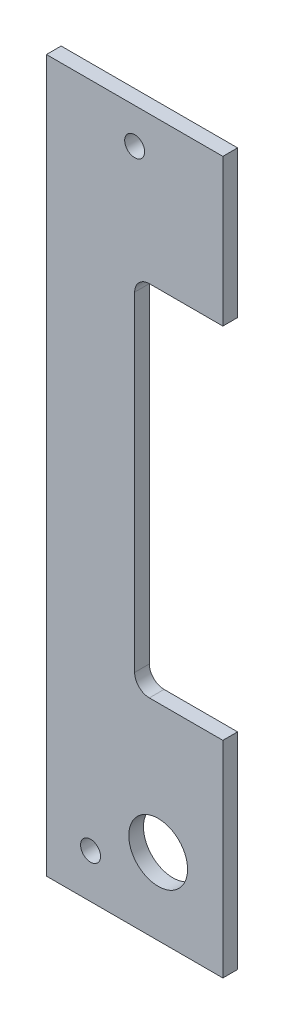
ISO-10303-21;
HEADER;
FILE_DESCRIPTION(('STEP AP214'),'2;1');
FILE_NAME('part.step','',(''),(''),'','','');
FILE_SCHEMA(('AUTOMOTIVE_DESIGN { 1 0 10303 214 1 1 1 1 }'));
ENDSEC;
DATA;
#1=APPLICATION_CONTEXT('core data for automotive mechanical design processes');
#2=APPLICATION_PROTOCOL_DEFINITION('international standard','automotive_design',2000,#1);
#3=PRODUCT_CONTEXT('',#1,'mechanical');
#4=PRODUCT('Part','Part','',(#3));
#5=PRODUCT_RELATED_PRODUCT_CATEGORY('part','',(#4));
#6=PRODUCT_DEFINITION_FORMATION('','',#4);
#7=PRODUCT_DEFINITION_CONTEXT('part definition',#1,'design');
#8=PRODUCT_DEFINITION('design','',#6,#7);
#9=PRODUCT_DEFINITION_SHAPE('','',#8);
#10=(LENGTH_UNIT() NAMED_UNIT(*) SI_UNIT(.MILLI.,.METRE.));
#11=(NAMED_UNIT(*) PLANE_ANGLE_UNIT() SI_UNIT($,.RADIAN.));
#12=(NAMED_UNIT(*) SI_UNIT($,.STERADIAN.) SOLID_ANGLE_UNIT());
#13=UNCERTAINTY_MEASURE_WITH_UNIT(LENGTH_MEASURE(1.E-05),#10,'distance_accuracy_value','');
#14=(GEOMETRIC_REPRESENTATION_CONTEXT(3) GLOBAL_UNCERTAINTY_ASSIGNED_CONTEXT((#13)) GLOBAL_UNIT_ASSIGNED_CONTEXT((#10,
#11,#12)) REPRESENTATION_CONTEXT('',''));
#15=CARTESIAN_POINT('',(0.,0.,0.));
#16=DIRECTION('',(0.,0.,1.));
#17=DIRECTION('',(1.,0.,0.));
#18=AXIS2_PLACEMENT_3D('',#15,#16,#17);
#19=CARTESIAN_POINT('',(-38.1,0.,3.175));
#20=DIRECTION('',(0.,1.,0.));
#21=DIRECTION('',(-1.,0.,0.));
#22=AXIS2_PLACEMENT_3D('',#19,#20,#21);
#23=PLANE('',#22);
#24=DIRECTION('',(1.,0.,0.));
#25=VECTOR('',#24,1.);
#26=CARTESIAN_POINT('',(-38.1,0.,0.));
#27=LINE('',#26,#25);
#28=CARTESIAN_POINT('',(-38.1,0.,0.));
#29=VERTEX_POINT('',#28);
#30=CARTESIAN_POINT('',(0.,0.,0.));
#31=VERTEX_POINT('',#30);
#32=EDGE_CURVE('E140',#29,#31,#27,.T.);
#33=ORIENTED_EDGE('',*,*,#32,.T.);
#34=DIRECTION('',(0.,0.,-1.));
#35=VECTOR('',#34,1.);
#36=CARTESIAN_POINT('',(0.,0.,3.175));
#37=LINE('',#36,#35);
#38=CARTESIAN_POINT('',(0.,0.,3.175));
#39=VERTEX_POINT('',#38);
#40=EDGE_CURVE('E11',#39,#31,#37,.T.);
#41=ORIENTED_EDGE('',*,*,#40,.F.);
#42=DIRECTION('',(1.,0.,0.));
#43=VECTOR('',#42,1.);
#44=CARTESIAN_POINT('',(-38.1,0.,3.175));
#45=LINE('',#44,#43);
#46=CARTESIAN_POINT('',(-38.1,0.,3.175));
#47=VERTEX_POINT('',#46);
#48=EDGE_CURVE('E159',#47,#39,#45,.T.);
#49=ORIENTED_EDGE('',*,*,#48,.F.);
#50=DIRECTION('',(0.,0.,-1.));
#51=VECTOR('',#50,1.);
#52=CARTESIAN_POINT('',(-38.1,0.,3.175));
#53=LINE('',#52,#51);
#54=EDGE_CURVE('E136',#47,#29,#53,.T.);
#55=ORIENTED_EDGE('',*,*,#54,.T.);
#56=EDGE_LOOP('',(#33,#41,#49,#55));
#57=FACE_BOUND('',#56,.T.);
#58=ADVANCED_FACE('F32',(#57),#23,.F.);
#59=CARTESIAN_POINT('',(0.,0.,3.175));
#60=DIRECTION('',(-1.,0.,0.));
#61=DIRECTION('',(0.,-1.,0.));
#62=AXIS2_PLACEMENT_3D('',#59,#60,#61);
#63=PLANE('',#62);
#64=DIRECTION('',(0.,1.,0.));
#65=VECTOR('',#64,1.);
#66=CARTESIAN_POINT('',(0.,0.,0.));
#67=LINE('',#66,#65);
#68=CARTESIAN_POINT('',(0.,44.45,0.));
#69=VERTEX_POINT('',#68);
#70=EDGE_CURVE('E143',#31,#69,#67,.T.);
#71=ORIENTED_EDGE('',*,*,#70,.T.);
#72=DIRECTION('',(0.,0.,-1.));
#73=VECTOR('',#72,1.);
#74=CARTESIAN_POINT('',(0.,44.45,3.175));
#75=LINE('',#74,#73);
#76=CARTESIAN_POINT('',(0.,44.45,3.175));
#77=VERTEX_POINT('',#76);
#78=EDGE_CURVE('E40',#77,#69,#75,.T.);
#79=ORIENTED_EDGE('',*,*,#78,.F.);
#80=DIRECTION('',(0.,1.,0.));
#81=VECTOR('',#80,1.);
#82=CARTESIAN_POINT('',(0.,0.,3.175));
#83=LINE('',#82,#81);
#84=EDGE_CURVE('E97',#39,#77,#83,.T.);
#85=ORIENTED_EDGE('',*,*,#84,.F.);
#86=ORIENTED_EDGE('',*,*,#40,.T.);
#87=EDGE_LOOP('',(#71,#79,#85,#86));
#88=FACE_BOUND('',#87,.T.);
#89=ADVANCED_FACE('F246',(#88),#63,.F.);
#90=CARTESIAN_POINT('',(0.,44.45,3.175));
#91=DIRECTION('',(0.,-1.,0.));
#92=DIRECTION('',(0.,0.,-1.));
#93=AXIS2_PLACEMENT_3D('',#90,#91,#92);
#94=PLANE('',#93);
#95=DIRECTION('',(-1.,0.,0.));
#96=VECTOR('',#95,1.);
#97=CARTESIAN_POINT('',(0.,44.45,0.));
#98=LINE('',#97,#96);
#99=CARTESIAN_POINT('',(-15.875,44.45,0.));
#100=VERTEX_POINT('',#99);
#101=EDGE_CURVE('E146',#69,#100,#98,.T.);
#102=ORIENTED_EDGE('',*,*,#101,.T.);
#103=DIRECTION('',(0.,0.,-1.));
#104=VECTOR('',#103,1.);
#105=CARTESIAN_POINT('',(-15.875,44.45,3.175));
#106=LINE('',#105,#104);
#107=CARTESIAN_POINT('',(-15.875,44.45,3.175));
#108=VERTEX_POINT('',#107);
#109=EDGE_CURVE('E172',#108,#100,#106,.T.);
#110=ORIENTED_EDGE('',*,*,#109,.F.);
#111=DIRECTION('',(-1.,0.,0.));
#112=VECTOR('',#111,1.);
#113=CARTESIAN_POINT('',(0.,44.45,3.175));
#114=LINE('',#113,#112);
#115=EDGE_CURVE('E180',#77,#108,#114,.T.);
#116=ORIENTED_EDGE('',*,*,#115,.F.);
#117=ORIENTED_EDGE('',*,*,#78,.T.);
#118=EDGE_LOOP('',(#102,#110,#116,#117));
#119=FACE_BOUND('',#118,.T.);
#120=ADVANCED_FACE('F178',(#119),#94,.F.);
#121=CARTESIAN_POINT('',(-15.875,47.625,3.175));
#122=DIRECTION('',(0.,0.,-1.));
#123=DIRECTION('',(-1.,0.,0.));
#124=AXIS2_PLACEMENT_3D('',#121,#122,#123);
#125=CYLINDRICAL_SURFACE('',#124,3.175);
#126=CARTESIAN_POINT('',(-15.875,47.625,0.));
#127=DIRECTION('',(0.,0.,-1.));
#128=DIRECTION('',(1.,0.,0.));
#129=AXIS2_PLACEMENT_3D('',#126,#127,#128);
#130=CIRCLE('',#129,3.175);
#131=CARTESIAN_POINT('',(-19.05,47.625,0.));
#132=VERTEX_POINT('',#131);
#133=EDGE_CURVE('E148',#100,#132,#130,.T.);
#134=ORIENTED_EDGE('',*,*,#133,.T.);
#135=DIRECTION('',(0.,0.,-1.));
#136=VECTOR('',#135,1.);
#137=CARTESIAN_POINT('',(-19.05,47.625,3.175));
#138=LINE('',#137,#136);
#139=CARTESIAN_POINT('',(-19.05,47.625,3.175));
#140=VERTEX_POINT('',#139);
#141=EDGE_CURVE('E169',#140,#132,#138,.T.);
#142=ORIENTED_EDGE('',*,*,#141,.F.);
#143=CARTESIAN_POINT('',(-15.875,47.625,3.175));
#144=DIRECTION('',(0.,0.,-1.));
#145=DIRECTION('',(1.,0.,0.));
#146=AXIS2_PLACEMENT_3D('',#143,#144,#145);
#147=CIRCLE('',#146,3.175);
#148=EDGE_CURVE('E198',#108,#140,#147,.T.);
#149=ORIENTED_EDGE('',*,*,#148,.F.);
#150=ORIENTED_EDGE('',*,*,#109,.T.);
#151=EDGE_LOOP('',(#134,#142,#149,#150));
#152=FACE_BOUND('',#151,.T.);
#153=ADVANCED_FACE('F189',(#152),#125,.F.);
#154=CARTESIAN_POINT('',(-19.05,47.625,3.175));
#155=DIRECTION('',(-1.,0.,0.));
#156=DIRECTION('',(0.,-1.,0.));
#157=AXIS2_PLACEMENT_3D('',#154,#155,#156);
#158=PLANE('',#157);
#159=DIRECTION('',(0.,1.,0.));
#160=VECTOR('',#159,1.);
#161=CARTESIAN_POINT('',(-19.05,47.625,0.));
#162=LINE('',#161,#160);
#163=CARTESIAN_POINT('',(-19.05,118.745,0.));
#164=VERTEX_POINT('',#163);
#165=EDGE_CURVE('E150',#132,#164,#162,.T.);
#166=ORIENTED_EDGE('',*,*,#165,.T.);
#167=DIRECTION('',(0.,0.,-1.));
#168=VECTOR('',#167,1.);
#169=CARTESIAN_POINT('',(-19.05,118.745,3.175));
#170=LINE('',#169,#168);
#171=CARTESIAN_POINT('',(-19.05,118.745,3.175));
#172=VERTEX_POINT('',#171);
#173=EDGE_CURVE('E166',#172,#164,#170,.T.);
#174=ORIENTED_EDGE('',*,*,#173,.F.);
#175=DIRECTION('',(0.,1.,0.));
#176=VECTOR('',#175,1.);
#177=CARTESIAN_POINT('',(-19.05,47.625,3.175));
#178=LINE('',#177,#176);
#179=EDGE_CURVE('E195',#140,#172,#178,.T.);
#180=ORIENTED_EDGE('',*,*,#179,.F.);
#181=ORIENTED_EDGE('',*,*,#141,.T.);
#182=EDGE_LOOP('',(#166,#174,#180,#181));
#183=FACE_BOUND('',#182,.T.);
#184=ADVANCED_FACE('F193',(#183),#158,.F.);
#185=CARTESIAN_POINT('',(-15.875,118.745,3.175));
#186=DIRECTION('',(0.,0.,-1.));
#187=DIRECTION('',(-1.,0.,0.));
#188=AXIS2_PLACEMENT_3D('',#185,#186,#187);
#189=CYLINDRICAL_SURFACE('',#188,3.175);
#190=CARTESIAN_POINT('',(-15.875,118.745,0.));
#191=DIRECTION('',(0.,0.,-1.));
#192=DIRECTION('',(1.,0.,0.));
#193=AXIS2_PLACEMENT_3D('',#190,#191,#192);
#194=CIRCLE('',#193,3.175);
#195=CARTESIAN_POINT('',(-15.875,121.92,0.));
#196=VERTEX_POINT('',#195);
#197=EDGE_CURVE('E152',#164,#196,#194,.T.);
#198=ORIENTED_EDGE('',*,*,#197,.T.);
#199=DIRECTION('',(0.,0.,-1.));
#200=VECTOR('',#199,1.);
#201=CARTESIAN_POINT('',(-15.875,121.92,3.175));
#202=LINE('',#201,#200);
#203=CARTESIAN_POINT('',(-15.875,121.92,3.175));
#204=VERTEX_POINT('',#203);
#205=EDGE_CURVE('E163',#204,#196,#202,.T.);
#206=ORIENTED_EDGE('',*,*,#205,.F.);
#207=CARTESIAN_POINT('',(-15.875,118.745,3.175));
#208=DIRECTION('',(0.,0.,-1.));
#209=DIRECTION('',(1.,0.,0.));
#210=AXIS2_PLACEMENT_3D('',#207,#208,#209);
#211=CIRCLE('',#210,3.175);
#212=EDGE_CURVE('E197',#172,#204,#211,.T.);
#213=ORIENTED_EDGE('',*,*,#212,.F.);
#214=ORIENTED_EDGE('',*,*,#173,.T.);
#215=EDGE_LOOP('',(#198,#206,#213,#214));
#216=FACE_BOUND('',#215,.T.);
#217=ADVANCED_FACE('F258',(#216),#189,.F.);
#218=CARTESIAN_POINT('',(-15.875,121.92,3.175));
#219=DIRECTION('',(0.,1.,0.));
#220=DIRECTION('',(0.,0.,1.));
#221=AXIS2_PLACEMENT_3D('',#218,#219,#220);
#222=PLANE('',#221);
#223=DIRECTION('',(1.,0.,0.));
#224=VECTOR('',#223,1.);
#225=CARTESIAN_POINT('',(-15.875,121.92,0.));
#226=LINE('',#225,#224);
#227=CARTESIAN_POINT('',(0.,121.92,0.));
#228=VERTEX_POINT('',#227);
#229=EDGE_CURVE('E154',#196,#228,#226,.T.);
#230=ORIENTED_EDGE('',*,*,#229,.T.);
#231=DIRECTION('',(0.,0.,-1.));
#232=VECTOR('',#231,1.);
#233=CARTESIAN_POINT('',(0.,121.92,3.175));
#234=LINE('',#233,#232);
#235=CARTESIAN_POINT('',(0.,121.92,3.175));
#236=VERTEX_POINT('',#235);
#237=EDGE_CURVE('E131',#236,#228,#234,.T.);
#238=ORIENTED_EDGE('',*,*,#237,.F.);
#239=DIRECTION('',(1.,0.,0.));
#240=VECTOR('',#239,1.);
#241=CARTESIAN_POINT('',(-15.875,121.92,3.175));
#242=LINE('',#241,#240);
#243=EDGE_CURVE('E122',#204,#236,#242,.T.);
#244=ORIENTED_EDGE('',*,*,#243,.F.);
#245=ORIENTED_EDGE('',*,*,#205,.T.);
#246=EDGE_LOOP('',(#230,#238,#244,#245));
#247=FACE_BOUND('',#246,.T.);
#248=ADVANCED_FACE('F255',(#247),#222,.F.);
#249=CARTESIAN_POINT('',(0.,121.92,3.175));
#250=DIRECTION('',(-1.,0.,0.));
#251=DIRECTION('',(0.,-1.,0.));
#252=AXIS2_PLACEMENT_3D('',#249,#250,#251);
#253=PLANE('',#252);
#254=DIRECTION('',(0.,1.,0.));
#255=VECTOR('',#254,1.);
#256=CARTESIAN_POINT('',(0.,121.92,0.));
#257=LINE('',#256,#255);
#258=CARTESIAN_POINT('',(0.,153.67,0.));
#259=VERTEX_POINT('',#258);
#260=EDGE_CURVE('E130',#228,#259,#257,.T.);
#261=ORIENTED_EDGE('',*,*,#260,.T.);
#262=DIRECTION('',(0.,0.,-1.));
#263=VECTOR('',#262,1.);
#264=CARTESIAN_POINT('',(0.,153.67,3.175));
#265=LINE('',#264,#263);
#266=CARTESIAN_POINT('',(0.,153.67,3.175));
#267=VERTEX_POINT('',#266);
#268=EDGE_CURVE('E127',#267,#259,#265,.T.);
#269=ORIENTED_EDGE('',*,*,#268,.F.);
#270=DIRECTION('',(0.,1.,0.));
#271=VECTOR('',#270,1.);
#272=CARTESIAN_POINT('',(0.,121.92,3.175));
#273=LINE('',#272,#271);
#274=EDGE_CURVE('E116',#236,#267,#273,.T.);
#275=ORIENTED_EDGE('',*,*,#274,.F.);
#276=ORIENTED_EDGE('',*,*,#237,.T.);
#277=EDGE_LOOP('',(#261,#269,#275,#276));
#278=FACE_BOUND('',#277,.T.);
#279=ADVANCED_FACE('F128',(#278),#253,.F.);
#280=CARTESIAN_POINT('',(0.,153.67,3.175));
#281=DIRECTION('',(0.,-1.,0.));
#282=DIRECTION('',(0.,0.,-1.));
#283=AXIS2_PLACEMENT_3D('',#280,#281,#282);
#284=PLANE('',#283);
#285=DIRECTION('',(-1.,0.,0.));
#286=VECTOR('',#285,1.);
#287=CARTESIAN_POINT('',(0.,153.67,0.));
#288=LINE('',#287,#286);
#289=CARTESIAN_POINT('',(-38.1,153.67,0.));
#290=VERTEX_POINT('',#289);
#291=EDGE_CURVE('E83',#259,#290,#288,.T.);
#292=ORIENTED_EDGE('',*,*,#291,.T.);
#293=DIRECTION('',(0.,0.,-1.));
#294=VECTOR('',#293,1.);
#295=CARTESIAN_POINT('',(-38.1,153.67,3.175));
#296=LINE('',#295,#294);
#297=CARTESIAN_POINT('',(-38.1,153.67,3.175));
#298=VERTEX_POINT('',#297);
#299=EDGE_CURVE('E132',#298,#290,#296,.T.);
#300=ORIENTED_EDGE('',*,*,#299,.F.);
#301=DIRECTION('',(-1.,0.,0.));
#302=VECTOR('',#301,1.);
#303=CARTESIAN_POINT('',(0.,153.67,3.175));
#304=LINE('',#303,#302);
#305=EDGE_CURVE('E120',#267,#298,#304,.T.);
#306=ORIENTED_EDGE('',*,*,#305,.F.);
#307=ORIENTED_EDGE('',*,*,#268,.T.);
#308=EDGE_LOOP('',(#292,#300,#306,#307));
#309=FACE_BOUND('',#308,.T.);
#310=ADVANCED_FACE('F134',(#309),#284,.F.);
#311=CARTESIAN_POINT('',(-38.1,153.67,3.175));
#312=DIRECTION('',(1.,0.,0.));
#313=DIRECTION('',(0.,0.,-1.));
#314=AXIS2_PLACEMENT_3D('',#311,#312,#313);
#315=PLANE('',#314);
#316=DIRECTION('',(0.,-1.,0.));
#317=VECTOR('',#316,1.);
#318=CARTESIAN_POINT('',(-38.1,153.67,0.));
#319=LINE('',#318,#317);
#320=EDGE_CURVE('E89',#290,#29,#319,.T.);
#321=ORIENTED_EDGE('',*,*,#320,.T.);
#322=ORIENTED_EDGE('',*,*,#54,.F.);
#323=DIRECTION('',(0.,-1.,0.));
#324=VECTOR('',#323,1.);
#325=CARTESIAN_POINT('',(-38.1,153.67,3.175));
#326=LINE('',#325,#324);
#327=EDGE_CURVE('E48',#298,#47,#326,.T.);
#328=ORIENTED_EDGE('',*,*,#327,.F.);
#329=ORIENTED_EDGE('',*,*,#299,.T.);
#330=EDGE_LOOP('',(#321,#322,#328,#329));
#331=FACE_BOUND('',#330,.T.);
#332=ADVANCED_FACE('F310',(#331),#315,.F.);
#333=CARTESIAN_POINT('',(-15.875,47.625,3.175));
#334=DIRECTION('',(0.,0.,1.));
#335=DIRECTION('',(1.,0.,0.));
#336=AXIS2_PLACEMENT_3D('',#333,#334,#335);
#337=PLANE('',#336);
#338=CARTESIAN_POINT('',(-13.97,16.51,3.175));
#339=DIRECTION('',(0.,0.,-1.));
#340=DIRECTION('',(-1.,0.,0.));
#341=AXIS2_PLACEMENT_3D('',#338,#339,#340);
#342=CIRCLE('',#341,6.35);
#343=CARTESIAN_POINT('',(-20.32,16.51,3.175));
#344=VERTEX_POINT('',#343);
#345=EDGE_CURVE('E217',#344,#344,#342,.T.);
#346=ORIENTED_EDGE('',*,*,#345,.T.);
#347=EDGE_LOOP('',(#346));
#348=FACE_BOUND('',#347,.T.);
#349=CARTESIAN_POINT('',(-28.575,9.525,3.175));
#350=DIRECTION('',(0.,0.,-1.));
#351=DIRECTION('',(-1.,0.,0.));
#352=AXIS2_PLACEMENT_3D('',#349,#350,#351);
#353=CIRCLE('',#352,2.15265);
#354=CARTESIAN_POINT('',(-30.72765,9.525,3.175));
#355=VERTEX_POINT('',#354);
#356=EDGE_CURVE('E211',#355,#355,#353,.T.);
#357=ORIENTED_EDGE('',*,*,#356,.T.);
#358=EDGE_LOOP('',(#357));
#359=FACE_BOUND('',#358,.T.);
#360=CARTESIAN_POINT('',(-19.05,146.05,3.175));
#361=DIRECTION('',(0.,0.,-1.));
#362=DIRECTION('',(-1.,0.,0.));
#363=AXIS2_PLACEMENT_3D('',#360,#361,#362);
#364=CIRCLE('',#363,2.15265);
#365=CARTESIAN_POINT('',(-21.20265,146.05,3.175));
#366=VERTEX_POINT('',#365);
#367=EDGE_CURVE('E144',#366,#366,#364,.T.);
#368=ORIENTED_EDGE('',*,*,#367,.T.);
#369=EDGE_LOOP('',(#368));
#370=FACE_BOUND('',#369,.T.);
#371=ORIENTED_EDGE('',*,*,#48,.T.);
#372=ORIENTED_EDGE('',*,*,#84,.T.);
#373=ORIENTED_EDGE('',*,*,#115,.T.);
#374=ORIENTED_EDGE('',*,*,#148,.T.);
#375=ORIENTED_EDGE('',*,*,#179,.T.);
#376=ORIENTED_EDGE('',*,*,#212,.T.);
#377=ORIENTED_EDGE('',*,*,#243,.T.);
#378=ORIENTED_EDGE('',*,*,#274,.T.);
#379=ORIENTED_EDGE('',*,*,#305,.T.);
#380=ORIENTED_EDGE('',*,*,#327,.T.);
#381=EDGE_LOOP('',(#371,#372,#373,#374,#375,#376,#377,#378,#379,#380));
#382=FACE_BOUND('',#381,.T.);
#383=ADVANCED_FACE('F118',(#348,#359,#370,#382),#337,.T.);
#384=CARTESIAN_POINT('',(-15.875,47.625,0.));
#385=DIRECTION('',(0.,0.,1.));
#386=DIRECTION('',(1.,0.,0.));
#387=AXIS2_PLACEMENT_3D('',#384,#385,#386);
#388=PLANE('',#387);
#389=CARTESIAN_POINT('',(-13.97,16.51,0.));
#390=DIRECTION('',(0.,0.,-1.));
#391=DIRECTION('',(-1.,0.,0.));
#392=AXIS2_PLACEMENT_3D('',#389,#390,#391);
#393=CIRCLE('',#392,6.35);
#394=CARTESIAN_POINT('',(-20.32,16.51,0.));
#395=VERTEX_POINT('',#394);
#396=EDGE_CURVE('E220',#395,#395,#393,.T.);
#397=ORIENTED_EDGE('',*,*,#396,.F.);
#398=EDGE_LOOP('',(#397));
#399=FACE_BOUND('',#398,.T.);
#400=CARTESIAN_POINT('',(-28.575,9.525,0.));
#401=DIRECTION('',(0.,0.,-1.));
#402=DIRECTION('',(-1.,0.,0.));
#403=AXIS2_PLACEMENT_3D('',#400,#401,#402);
#404=CIRCLE('',#403,2.15265);
#405=CARTESIAN_POINT('',(-30.72765,9.525,0.));
#406=VERTEX_POINT('',#405);
#407=EDGE_CURVE('E214',#406,#406,#404,.T.);
#408=ORIENTED_EDGE('',*,*,#407,.F.);
#409=EDGE_LOOP('',(#408));
#410=FACE_BOUND('',#409,.T.);
#411=CARTESIAN_POINT('',(-19.05,146.05,0.));
#412=DIRECTION('',(0.,0.,-1.));
#413=DIRECTION('',(-1.,0.,0.));
#414=AXIS2_PLACEMENT_3D('',#411,#412,#413);
#415=CIRCLE('',#414,2.15265);
#416=CARTESIAN_POINT('',(-21.20265,146.05,0.));
#417=VERTEX_POINT('',#416);
#418=EDGE_CURVE('E208',#417,#417,#415,.T.);
#419=ORIENTED_EDGE('',*,*,#418,.F.);
#420=EDGE_LOOP('',(#419));
#421=FACE_BOUND('',#420,.T.);
#422=ORIENTED_EDGE('',*,*,#32,.F.);
#423=ORIENTED_EDGE('',*,*,#320,.F.);
#424=ORIENTED_EDGE('',*,*,#291,.F.);
#425=ORIENTED_EDGE('',*,*,#260,.F.);
#426=ORIENTED_EDGE('',*,*,#229,.F.);
#427=ORIENTED_EDGE('',*,*,#197,.F.);
#428=ORIENTED_EDGE('',*,*,#165,.F.);
#429=ORIENTED_EDGE('',*,*,#133,.F.);
#430=ORIENTED_EDGE('',*,*,#101,.F.);
#431=ORIENTED_EDGE('',*,*,#70,.F.);
#432=EDGE_LOOP('',(#422,#423,#424,#425,#426,#427,#428,#429,#430,#431));
#433=FACE_BOUND('',#432,.T.);
#434=ADVANCED_FACE('F184',(#399,#410,#421,#433),#388,.F.);
#435=CARTESIAN_POINT('',(-19.05,146.05,0.));
#436=DIRECTION('',(0.,0.,-1.));
#437=DIRECTION('',(-1.,0.,0.));
#438=AXIS2_PLACEMENT_3D('',#435,#436,#437);
#439=CYLINDRICAL_SURFACE('',#438,2.15265);
#440=ORIENTED_EDGE('',*,*,#367,.F.);
#441=EDGE_LOOP('',(#440));
#442=FACE_BOUND('',#441,.T.);
#443=ORIENTED_EDGE('',*,*,#418,.T.);
#444=EDGE_LOOP('',(#443));
#445=FACE_BOUND('',#444,.T.);
#446=ADVANCED_FACE('F228',(#442,#445),#439,.F.);
#447=CARTESIAN_POINT('',(-28.575,9.525,0.));
#448=DIRECTION('',(0.,0.,-1.));
#449=DIRECTION('',(-1.,0.,0.));
#450=AXIS2_PLACEMENT_3D('',#447,#448,#449);
#451=CYLINDRICAL_SURFACE('',#450,2.15265);
#452=ORIENTED_EDGE('',*,*,#356,.F.);
#453=EDGE_LOOP('',(#452));
#454=FACE_BOUND('',#453,.T.);
#455=ORIENTED_EDGE('',*,*,#407,.T.);
#456=EDGE_LOOP('',(#455));
#457=FACE_BOUND('',#456,.T.);
#458=ADVANCED_FACE('F235',(#454,#457),#451,.F.);
#459=CARTESIAN_POINT('',(-13.97,16.51,0.));
#460=DIRECTION('',(0.,0.,-1.));
#461=DIRECTION('',(-1.,0.,0.));
#462=AXIS2_PLACEMENT_3D('',#459,#460,#461);
#463=CYLINDRICAL_SURFACE('',#462,6.35);
#464=ORIENTED_EDGE('',*,*,#345,.F.);
#465=EDGE_LOOP('',(#464));
#466=FACE_BOUND('',#465,.T.);
#467=ORIENTED_EDGE('',*,*,#396,.T.);
#468=EDGE_LOOP('',(#467));
#469=FACE_BOUND('',#468,.T.);
#470=ADVANCED_FACE('F224',(#466,#469),#463,.F.);
#471=CLOSED_SHELL('',(#58,#89,#120,#153,#184,#217,#248,#279,#310,#332,#383,#434,#446,#458,#470));
#472=MANIFOLD_SOLID_BREP('B2',#471);
#473=ADVANCED_BREP_SHAPE_REPRESENTATION('',(#18,#472),#14);
#474=SHAPE_DEFINITION_REPRESENTATION(#9,#473);
ENDSEC;
END-ISO-10303-21;
